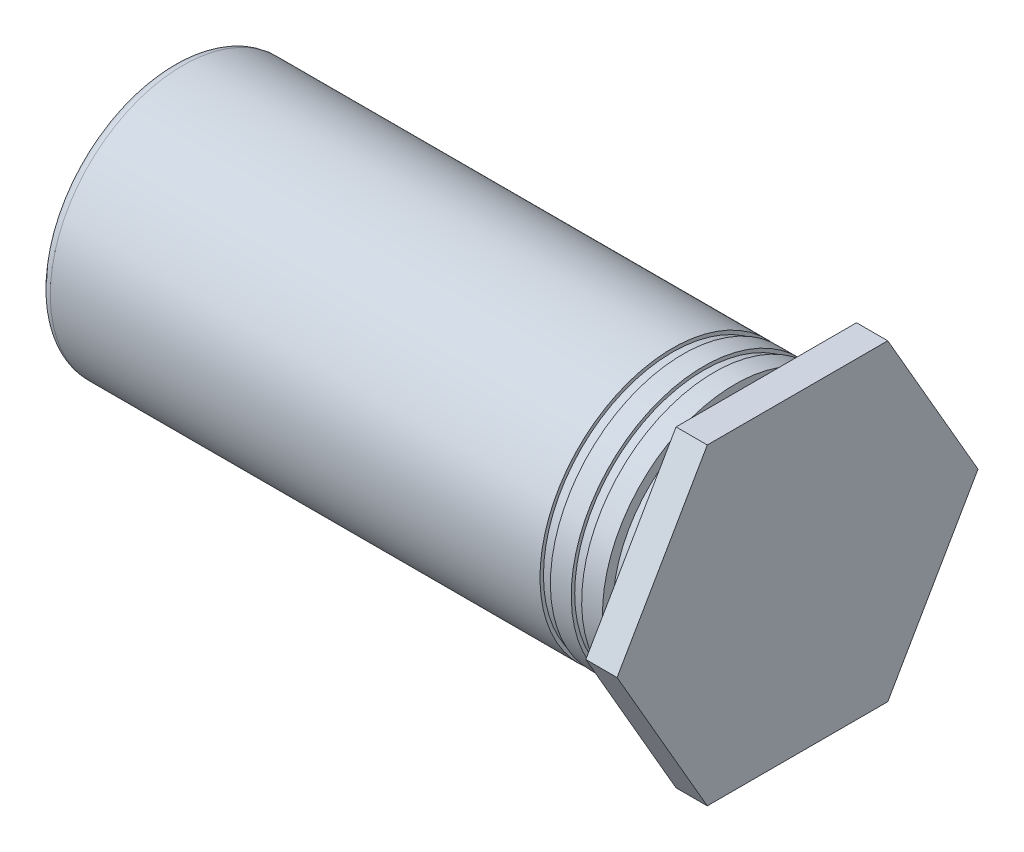
ISO-10303-21;
HEADER;
FILE_DESCRIPTION(('STEP AP214'),'2;1');
FILE_NAME('part.step','',(''),(''),'','','');
FILE_SCHEMA(('AUTOMOTIVE_DESIGN { 1 0 10303 214 1 1 1 1 }'));
ENDSEC;
DATA;
#1=APPLICATION_CONTEXT('core data for automotive mechanical design processes');
#2=APPLICATION_PROTOCOL_DEFINITION('international standard','automotive_design',2000,#1);
#3=PRODUCT_CONTEXT('',#1,'mechanical');
#4=PRODUCT('Part','Part','',(#3));
#5=PRODUCT_RELATED_PRODUCT_CATEGORY('part','',(#4));
#6=PRODUCT_DEFINITION_FORMATION('','',#4);
#7=PRODUCT_DEFINITION_CONTEXT('part definition',#1,'design');
#8=PRODUCT_DEFINITION('design','',#6,#7);
#9=PRODUCT_DEFINITION_SHAPE('','',#8);
#10=(LENGTH_UNIT() NAMED_UNIT(*) SI_UNIT(.MILLI.,.METRE.));
#11=(NAMED_UNIT(*) PLANE_ANGLE_UNIT() SI_UNIT($,.RADIAN.));
#12=(NAMED_UNIT(*) SI_UNIT($,.STERADIAN.) SOLID_ANGLE_UNIT());
#13=UNCERTAINTY_MEASURE_WITH_UNIT(LENGTH_MEASURE(1.E-05),#10,'distance_accuracy_value','');
#14=(GEOMETRIC_REPRESENTATION_CONTEXT(3) GLOBAL_UNCERTAINTY_ASSIGNED_CONTEXT((#13)) GLOBAL_UNIT_ASSIGNED_CONTEXT((#10,
#11,#12)) REPRESENTATION_CONTEXT('',''));
#15=CARTESIAN_POINT('',(0.,0.,0.));
#16=DIRECTION('',(0.,0.,1.));
#17=DIRECTION('',(1.,0.,0.));
#18=AXIS2_PLACEMENT_3D('',#15,#16,#17);
#19=CARTESIAN_POINT('',(0.635000000000001,-1.905,0.));
#20=DIRECTION('',(1.,0.,0.));
#21=DIRECTION('',(0.,1.,0.));
#22=AXIS2_PLACEMENT_3D('',#19,#20,#21);
#23=PLANE('',#22);
#24=DIRECTION('',(0.,0.,-1.));
#25=VECTOR('',#24,1.);
#26=CARTESIAN_POINT('',(0.635,-3.175,0.));
#27=LINE('',#26,#25);
#28=CARTESIAN_POINT('',(0.635,-3.175,-1.83308710467706));
#29=VERTEX_POINT('',#28);
#30=CARTESIAN_POINT('',(0.635,-3.175,1.83308710467706));
#31=VERTEX_POINT('',#30);
#32=EDGE_CURVE('E199',#29,#31,#27,.F.);
#33=ORIENTED_EDGE('',*,*,#32,.F.);
#34=DIRECTION('',(0.,0.866025403784439,-0.5));
#35=VECTOR('',#34,1.);
#36=CARTESIAN_POINT('',(0.635,-1.5875,-2.74963065701559));
#37=LINE('',#36,#35);
#38=CARTESIAN_POINT('',(0.635,0.,-3.66617420935412));
#39=VERTEX_POINT('',#38);
#40=EDGE_CURVE('E73',#39,#29,#37,.F.);
#41=ORIENTED_EDGE('',*,*,#40,.F.);
#42=DIRECTION('',(0.,0.866025403784438,0.500000000000001));
#43=VECTOR('',#42,1.);
#44=CARTESIAN_POINT('',(0.635,1.5875,-2.74963065701559));
#45=LINE('',#44,#43);
#46=CARTESIAN_POINT('',(0.635,3.175,-1.83308710467706));
#47=VERTEX_POINT('',#46);
#48=EDGE_CURVE('E69',#47,#39,#45,.F.);
#49=ORIENTED_EDGE('',*,*,#48,.F.);
#50=DIRECTION('',(0.,0.,1.));
#51=VECTOR('',#50,1.);
#52=CARTESIAN_POINT('',(0.635,3.175,0.));
#53=LINE('',#52,#51);
#54=CARTESIAN_POINT('',(0.635,3.175,1.83308710467706));
#55=VERTEX_POINT('',#54);
#56=EDGE_CURVE('E90',#55,#47,#53,.F.);
#57=ORIENTED_EDGE('',*,*,#56,.F.);
#58=DIRECTION('',(0.,-0.866025403784439,0.5));
#59=VECTOR('',#58,1.);
#60=CARTESIAN_POINT('',(0.635,1.5875,2.74963065701559));
#61=LINE('',#60,#59);
#62=CARTESIAN_POINT('',(0.635,0.,3.66617420935412));
#63=VERTEX_POINT('',#62);
#64=EDGE_CURVE('E210',#63,#55,#61,.F.);
#65=ORIENTED_EDGE('',*,*,#64,.F.);
#66=DIRECTION('',(0.,-0.866025403784438,-0.5));
#67=VECTOR('',#66,1.);
#68=CARTESIAN_POINT('',(0.635,-1.5875,2.74963065701559));
#69=LINE('',#68,#67);
#70=EDGE_CURVE('E203',#31,#63,#69,.F.);
#71=ORIENTED_EDGE('',*,*,#70,.F.);
#72=EDGE_LOOP('',(#33,#41,#49,#57,#65,#71));
#73=FACE_BOUND('',#72,.T.);
#74=ADVANCED_FACE('F17',(#73),#23,.T.);
#75=CARTESIAN_POINT('',(0.3175,1.5875,-2.74963065701559));
#76=DIRECTION('',(0.,0.500000000000001,-0.866025403784438));
#77=DIRECTION('',(0.,0.866025403784438,0.500000000000001));
#78=AXIS2_PLACEMENT_3D('',#75,#76,#77);
#79=PLANE('',#78);
#80=DIRECTION('',(1.,0.,0.));
#81=VECTOR('',#80,1.);
#82=CARTESIAN_POINT('',(0.3175,0.,-3.66617420935412));
#83=LINE('',#82,#81);
#84=CARTESIAN_POINT('',(0.,0.,-3.66617420935412));
#85=VERTEX_POINT('',#84);
#86=EDGE_CURVE('E60',#85,#39,#83,.T.);
#87=ORIENTED_EDGE('',*,*,#86,.F.);
#88=DIRECTION('',(0.,-0.866025403784438,-0.500000000000001));
#89=VECTOR('',#88,1.);
#90=CARTESIAN_POINT('',(0.,3.175,-1.83308710467706));
#91=LINE('',#90,#89);
#92=CARTESIAN_POINT('',(0.,3.175,-1.83308710467706));
#93=VERTEX_POINT('',#92);
#94=EDGE_CURVE('E65',#93,#85,#91,.T.);
#95=ORIENTED_EDGE('',*,*,#94,.F.);
#96=DIRECTION('',(1.,0.,0.));
#97=VECTOR('',#96,1.);
#98=CARTESIAN_POINT('',(0.3175,3.175,-1.83308710467706));
#99=LINE('',#98,#97);
#100=EDGE_CURVE('E186',#47,#93,#99,.F.);
#101=ORIENTED_EDGE('',*,*,#100,.F.);
#102=ORIENTED_EDGE('',*,*,#48,.T.);
#103=EDGE_LOOP('',(#87,#95,#101,#102));
#104=FACE_BOUND('',#103,.T.);
#105=ADVANCED_FACE('F62',(#104),#79,.T.);
#106=CARTESIAN_POINT('',(0.3175,-1.5875,-2.74963065701559));
#107=DIRECTION('',(0.,-0.5,-0.866025403784439));
#108=DIRECTION('',(0.,0.866025403784439,-0.5));
#109=AXIS2_PLACEMENT_3D('',#106,#107,#108);
#110=PLANE('',#109);
#111=DIRECTION('',(1.,0.,0.));
#112=VECTOR('',#111,1.);
#113=CARTESIAN_POINT('',(0.3175,-3.175,-1.83308710467706));
#114=LINE('',#113,#112);
#115=CARTESIAN_POINT('',(0.,-3.175,-1.83308710467706));
#116=VERTEX_POINT('',#115);
#117=EDGE_CURVE('E79',#116,#29,#114,.T.);
#118=ORIENTED_EDGE('',*,*,#117,.F.);
#119=DIRECTION('',(0.,-0.866025403784439,0.5));
#120=VECTOR('',#119,1.);
#121=CARTESIAN_POINT('',(0.,0.,-3.66617420935412));
#122=LINE('',#121,#120);
#123=EDGE_CURVE('E76',#85,#116,#122,.T.);
#124=ORIENTED_EDGE('',*,*,#123,.F.);
#125=ORIENTED_EDGE('',*,*,#86,.T.);
#126=ORIENTED_EDGE('',*,*,#40,.T.);
#127=EDGE_LOOP('',(#118,#124,#125,#126));
#128=FACE_BOUND('',#127,.T.);
#129=ADVANCED_FACE('F77',(#128),#110,.T.);
#130=CARTESIAN_POINT('',(0.3175,-3.175,0.));
#131=DIRECTION('',(0.,-1.,0.));
#132=DIRECTION('',(0.,0.,-1.));
#133=AXIS2_PLACEMENT_3D('',#130,#131,#132);
#134=PLANE('',#133);
#135=DIRECTION('',(1.,0.,0.));
#136=VECTOR('',#135,1.);
#137=CARTESIAN_POINT('',(0.3175,-3.175,1.83308710467706));
#138=LINE('',#137,#136);
#139=CARTESIAN_POINT('',(0.,-3.175,1.83308710467706));
#140=VERTEX_POINT('',#139);
#141=EDGE_CURVE('E196',#140,#31,#138,.T.);
#142=ORIENTED_EDGE('',*,*,#141,.F.);
#143=DIRECTION('',(0.,0.,1.));
#144=VECTOR('',#143,1.);
#145=CARTESIAN_POINT('',(0.,-3.175,0.));
#146=LINE('',#145,#144);
#147=EDGE_CURVE('E83',#116,#140,#146,.T.);
#148=ORIENTED_EDGE('',*,*,#147,.F.);
#149=ORIENTED_EDGE('',*,*,#117,.T.);
#150=ORIENTED_EDGE('',*,*,#32,.T.);
#151=EDGE_LOOP('',(#142,#148,#149,#150));
#152=FACE_BOUND('',#151,.T.);
#153=ADVANCED_FACE('F192',(#152),#134,.T.);
#154=CARTESIAN_POINT('',(0.3175,-1.5875,2.74963065701559));
#155=DIRECTION('',(0.,-0.5,0.866025403784438));
#156=DIRECTION('',(0.,-0.866025403784438,-0.5));
#157=AXIS2_PLACEMENT_3D('',#154,#155,#156);
#158=PLANE('',#157);
#159=DIRECTION('',(1.,0.,0.));
#160=VECTOR('',#159,1.);
#161=CARTESIAN_POINT('',(0.3175,0.,3.66617420935412));
#162=LINE('',#161,#160);
#163=CARTESIAN_POINT('',(0.,0.,3.66617420935412));
#164=VERTEX_POINT('',#163);
#165=EDGE_CURVE('E207',#164,#63,#162,.T.);
#166=ORIENTED_EDGE('',*,*,#165,.F.);
#167=DIRECTION('',(0.,0.866025403784438,0.5));
#168=VECTOR('',#167,1.);
#169=CARTESIAN_POINT('',(0.,-3.175,1.83308710467706));
#170=LINE('',#169,#168);
#171=EDGE_CURVE('E183',#140,#164,#170,.T.);
#172=ORIENTED_EDGE('',*,*,#171,.F.);
#173=ORIENTED_EDGE('',*,*,#141,.T.);
#174=ORIENTED_EDGE('',*,*,#70,.T.);
#175=EDGE_LOOP('',(#166,#172,#173,#174));
#176=FACE_BOUND('',#175,.T.);
#177=ADVANCED_FACE('F205',(#176),#158,.T.);
#178=CARTESIAN_POINT('',(0.3175,1.5875,2.74963065701559));
#179=DIRECTION('',(0.,0.5,0.866025403784439));
#180=DIRECTION('',(0.,-0.866025403784439,0.5));
#181=AXIS2_PLACEMENT_3D('',#178,#179,#180);
#182=PLANE('',#181);
#183=DIRECTION('',(1.,0.,0.));
#184=VECTOR('',#183,1.);
#185=CARTESIAN_POINT('',(0.3175,3.175,1.83308710467706));
#186=LINE('',#185,#184);
#187=CARTESIAN_POINT('',(0.,3.175,1.83308710467706));
#188=VERTEX_POINT('',#187);
#189=EDGE_CURVE('E38',#188,#55,#186,.T.);
#190=ORIENTED_EDGE('',*,*,#189,.F.);
#191=DIRECTION('',(0.,0.866025403784439,-0.5));
#192=VECTOR('',#191,1.);
#193=CARTESIAN_POINT('',(0.,0.,3.66617420935412));
#194=LINE('',#193,#192);
#195=EDGE_CURVE('E181',#164,#188,#194,.T.);
#196=ORIENTED_EDGE('',*,*,#195,.F.);
#197=ORIENTED_EDGE('',*,*,#165,.T.);
#198=ORIENTED_EDGE('',*,*,#64,.T.);
#199=EDGE_LOOP('',(#190,#196,#197,#198));
#200=FACE_BOUND('',#199,.T.);
#201=ADVANCED_FACE('F212',(#200),#182,.T.);
#202=CARTESIAN_POINT('',(0.3175,3.175,0.));
#203=DIRECTION('',(0.,1.,0.));
#204=DIRECTION('',(0.,0.,1.));
#205=AXIS2_PLACEMENT_3D('',#202,#203,#204);
#206=PLANE('',#205);
#207=ORIENTED_EDGE('',*,*,#189,.T.);
#208=ORIENTED_EDGE('',*,*,#56,.T.);
#209=ORIENTED_EDGE('',*,*,#100,.T.);
#210=DIRECTION('',(0.,0.,1.));
#211=VECTOR('',#210,1.);
#212=CARTESIAN_POINT('',(0.,3.175,0.));
#213=LINE('',#212,#211);
#214=EDGE_CURVE('E89',#188,#93,#213,.F.);
#215=ORIENTED_EDGE('',*,*,#214,.F.);
#216=EDGE_LOOP('',(#207,#208,#209,#215));
#217=FACE_BOUND('',#216,.T.);
#218=ADVANCED_FACE('F214',(#217),#206,.T.);
#219=CARTESIAN_POINT('',(0.,-3.2512,0.));
#220=DIRECTION('',(-1.,0.,0.));
#221=DIRECTION('',(0.,-1.,0.));
#222=AXIS2_PLACEMENT_3D('',#219,#220,#221);
#223=PLANE('',#222);
#224=ORIENTED_EDGE('',*,*,#195,.T.);
#225=ORIENTED_EDGE('',*,*,#214,.T.);
#226=ORIENTED_EDGE('',*,*,#94,.T.);
#227=ORIENTED_EDGE('',*,*,#123,.T.);
#228=ORIENTED_EDGE('',*,*,#147,.T.);
#229=ORIENTED_EDGE('',*,*,#171,.T.);
#230=EDGE_LOOP('',(#224,#225,#226,#227,#228,#229));
#231=FACE_BOUND('',#230,.T.);
#232=CARTESIAN_POINT('',(0.,0.,0.));
#233=DIRECTION('',(-1.,0.,0.));
#234=DIRECTION('',(0.,0.,1.));
#235=AXIS2_PLACEMENT_3D('',#232,#233,#234);
#236=CIRCLE('',#235,2.48073333333333);
#237=CARTESIAN_POINT('',(0.,0.,2.48073333333333));
#238=VERTEX_POINT('',#237);
#239=EDGE_CURVE('E21',#238,#238,#236,.F.);
#240=ORIENTED_EDGE('',*,*,#239,.T.);
#241=EDGE_LOOP('',(#240));
#242=FACE_BOUND('',#241,.T.);
#243=ADVANCED_FACE('F87',(#231,#242),#223,.T.);
#244=CARTESIAN_POINT('',(0.,0.,0.));
#245=DIRECTION('',(-1.,0.,0.));
#246=DIRECTION('',(0.,0.,1.));
#247=AXIS2_PLACEMENT_3D('',#244,#245,#246);
#248=CYLINDRICAL_SURFACE('',#247,2.48073333333333);
#249=ORIENTED_EDGE('',*,*,#239,.F.);
#250=EDGE_LOOP('',(#249));
#251=FACE_BOUND('',#250,.T.);
#252=CARTESIAN_POINT('',(-0.635,0.,0.));
#253=DIRECTION('',(-1.,0.,0.));
#254=DIRECTION('',(0.,0.,1.));
#255=AXIS2_PLACEMENT_3D('',#252,#253,#254);
#256=CIRCLE('',#255,2.48073333333333);
#257=CARTESIAN_POINT('',(-0.635,0.,2.48073333333333));
#258=VERTEX_POINT('',#257);
#259=EDGE_CURVE('E175',#258,#258,#256,.F.);
#260=ORIENTED_EDGE('',*,*,#259,.T.);
#261=EDGE_LOOP('',(#260));
#262=FACE_BOUND('',#261,.T.);
#263=ADVANCED_FACE('F331',(#251,#262),#248,.T.);
#264=CARTESIAN_POINT('',(-0.635,0.,-2.58656666666667));
#265=DIRECTION('',(-1.,0.,0.));
#266=DIRECTION('',(0.,0.,1.));
#267=AXIS2_PLACEMENT_3D('',#264,#265,#266);
#268=PLANE('',#267);
#269=CARTESIAN_POINT('',(-0.635,0.,0.));
#270=DIRECTION('',(-1.,0.,0.));
#271=DIRECTION('',(0.,-1.,0.));
#272=AXIS2_PLACEMENT_3D('',#269,#270,#271);
#273=CIRCLE('',#272,2.6924);
#274=CARTESIAN_POINT('',(-0.635,-2.6924,0.));
#275=VERTEX_POINT('',#274);
#276=EDGE_CURVE('E173',#275,#275,#273,.T.);
#277=ORIENTED_EDGE('',*,*,#276,.F.);
#278=EDGE_LOOP('',(#277));
#279=FACE_BOUND('',#278,.T.);
#280=ORIENTED_EDGE('',*,*,#259,.F.);
#281=EDGE_LOOP('',(#280));
#282=FACE_BOUND('',#281,.T.);
#283=ADVANCED_FACE('F323',(#279,#282),#268,.F.);
#284=CARTESIAN_POINT('',(-5.92666666666667,0.,0.));
#285=DIRECTION('',(-1.,0.,0.));
#286=DIRECTION('',(0.,-1.,0.));
#287=AXIS2_PLACEMENT_3D('',#284,#285,#286);
#288=CYLINDRICAL_SURFACE('',#287,2.6924);
#289=CARTESIAN_POINT('',(-1.05833333333333,0.,0.));
#290=DIRECTION('',(-1.,0.,0.));
#291=DIRECTION('',(0.,-1.,0.));
#292=AXIS2_PLACEMENT_3D('',#289,#290,#291);
#293=CIRCLE('',#292,2.6924);
#294=CARTESIAN_POINT('',(-1.05833333333333,-2.6924,0.));
#295=VERTEX_POINT('',#294);
#296=EDGE_CURVE('E170',#295,#295,#293,.F.);
#297=ORIENTED_EDGE('',*,*,#296,.T.);
#298=EDGE_LOOP('',(#297));
#299=FACE_BOUND('',#298,.T.);
#300=ORIENTED_EDGE('',*,*,#276,.T.);
#301=EDGE_LOOP('',(#300));
#302=FACE_BOUND('',#301,.T.);
#303=ADVANCED_FACE('F316',(#299,#302),#288,.T.);
#304=CARTESIAN_POINT('',(-1.05833333333333,0.,-2.65712222222222));
#305=DIRECTION('',(1.,0.,0.));
#306=DIRECTION('',(0.,1.,0.));
#307=AXIS2_PLACEMENT_3D('',#304,#305,#306);
#308=PLANE('',#307);
#309=CARTESIAN_POINT('',(-1.05833333333333,0.,0.));
#310=DIRECTION('',(-1.,0.,0.));
#311=DIRECTION('',(0.,0.,1.));
#312=AXIS2_PLACEMENT_3D('',#309,#310,#311);
#313=CIRCLE('',#312,2.62184444444444);
#314=CARTESIAN_POINT('',(-1.05833333333333,0.,2.62184444444444));
#315=VERTEX_POINT('',#314);
#316=EDGE_CURVE('E144',#315,#315,#313,.F.);
#317=ORIENTED_EDGE('',*,*,#316,.T.);
#318=EDGE_LOOP('',(#317));
#319=FACE_BOUND('',#318,.T.);
#320=ORIENTED_EDGE('',*,*,#296,.F.);
#321=EDGE_LOOP('',(#320));
#322=FACE_BOUND('',#321,.T.);
#323=ADVANCED_FACE('F280',(#319,#322),#308,.F.);
#324=CARTESIAN_POINT('',(-1.90499999996518,0.,0.));
#325=DIRECTION('',(-1.,0.,0.));
#326=DIRECTION('',(0.,-1.,0.));
#327=AXIS2_PLACEMENT_3D('',#324,#325,#326);
#328=CONICAL_SURFACE('',#327,1.48589999992055,1.0471975510434);
#329=CARTESIAN_POINT('',(-1.04711523491119,0.,5.68440304762754E-11));
#330=VERTEX_POINT('',#329);
#331=VERTEX_LOOP('',#330);
#332=FACE_BOUND('',#331,.T.);
#333=CARTESIAN_POINT('',(-1.905,0.,0.));
#334=DIRECTION('',(-1.,0.,0.));
#335=DIRECTION('',(0.,-1.,0.));
#336=AXIS2_PLACEMENT_3D('',#333,#334,#335);
#337=CIRCLE('',#336,1.4859);
#338=CARTESIAN_POINT('',(-1.905,-1.4859,0.));
#339=VERTEX_POINT('',#338);
#340=EDGE_CURVE('E140',#339,#339,#337,.T.);
#341=ORIENTED_EDGE('',*,*,#340,.T.);
#342=EDGE_LOOP('',(#341));
#343=FACE_BOUND('',#342,.T.);
#344=ADVANCED_FACE('F270',(#332,#343),#328,.F.);
#345=CARTESIAN_POINT('',(-1.05833333333333,0.,0.));
#346=DIRECTION('',(-1.,0.,0.));
#347=DIRECTION('',(0.,0.,1.));
#348=AXIS2_PLACEMENT_3D('',#345,#346,#347);
#349=CYLINDRICAL_SURFACE('',#348,2.62184444444444);
#350=ORIENTED_EDGE('',*,*,#316,.F.);
#351=EDGE_LOOP('',(#350));
#352=FACE_BOUND('',#351,.T.);
#353=CARTESIAN_POINT('',(-1.27,0.,0.));
#354=DIRECTION('',(-1.,0.,0.));
#355=DIRECTION('',(0.,0.,1.));
#356=AXIS2_PLACEMENT_3D('',#353,#354,#355);
#357=CIRCLE('',#356,2.62184444444444);
#358=CARTESIAN_POINT('',(-1.27,0.,2.62184444444444));
#359=VERTEX_POINT('',#358);
#360=EDGE_CURVE('E143',#359,#359,#357,.F.);
#361=ORIENTED_EDGE('',*,*,#360,.T.);
#362=EDGE_LOOP('',(#361));
#363=FACE_BOUND('',#362,.T.);
#364=ADVANCED_FACE('F268',(#352,#363),#349,.T.);
#365=CARTESIAN_POINT('',(-3.81,0.,0.));
#366=DIRECTION('',(-1.,0.,0.));
#367=DIRECTION('',(0.,-1.,0.));
#368=AXIS2_PLACEMENT_3D('',#365,#366,#367);
#369=CYLINDRICAL_SURFACE('',#368,1.4859);
#370=CARTESIAN_POINT('',(-5.715,0.,0.));
#371=DIRECTION('',(-1.,0.,0.));
#372=DIRECTION('',(0.,-1.,0.));
#373=AXIS2_PLACEMENT_3D('',#370,#371,#372);
#374=CIRCLE('',#373,1.4859);
#375=CARTESIAN_POINT('',(-5.715,-1.4859,0.));
#376=VERTEX_POINT('',#375);
#377=EDGE_CURVE('E163',#376,#376,#374,.F.);
#378=ORIENTED_EDGE('',*,*,#377,.F.);
#379=EDGE_LOOP('',(#378));
#380=FACE_BOUND('',#379,.T.);
#381=ORIENTED_EDGE('',*,*,#340,.F.);
#382=EDGE_LOOP('',(#381));
#383=FACE_BOUND('',#382,.T.);
#384=ADVANCED_FACE('F264',(#380,#383),#369,.F.);
#385=CARTESIAN_POINT('',(-1.27,0.,-2.65712222222222));
#386=DIRECTION('',(-1.,0.,0.));
#387=DIRECTION('',(0.,0.,1.));
#388=AXIS2_PLACEMENT_3D('',#385,#386,#387);
#389=PLANE('',#388);
#390=CARTESIAN_POINT('',(-1.27,0.,0.));
#391=DIRECTION('',(-1.,0.,0.));
#392=DIRECTION('',(0.,-1.,0.));
#393=AXIS2_PLACEMENT_3D('',#390,#391,#392);
#394=CIRCLE('',#393,2.6924);
#395=CARTESIAN_POINT('',(-1.27,-2.6924,0.));
#396=VERTEX_POINT('',#395);
#397=EDGE_CURVE('E160',#396,#396,#394,.T.);
#398=ORIENTED_EDGE('',*,*,#397,.F.);
#399=EDGE_LOOP('',(#398));
#400=FACE_BOUND('',#399,.T.);
#401=ORIENTED_EDGE('',*,*,#360,.F.);
#402=EDGE_LOOP('',(#401));
#403=FACE_BOUND('',#402,.T.);
#404=ADVANCED_FACE('F261',(#400,#403),#389,.F.);
#405=CARTESIAN_POINT('',(-5.715,0.,-1.55575));
#406=DIRECTION('',(1.,0.,0.));
#407=DIRECTION('',(0.,0.,-1.));
#408=AXIS2_PLACEMENT_3D('',#405,#406,#407);
#409=PLANE('',#408);
#410=CARTESIAN_POINT('',(-5.715,0.,0.));
#411=DIRECTION('',(-1.,0.,0.));
#412=DIRECTION('',(0.,-1.,0.));
#413=AXIS2_PLACEMENT_3D('',#410,#411,#412);
#414=CIRCLE('',#413,1.3589);
#415=CARTESIAN_POINT('',(-5.715,-1.3589,0.));
#416=VERTEX_POINT('',#415);
#417=EDGE_CURVE('E157',#416,#416,#414,.F.);
#418=ORIENTED_EDGE('',*,*,#417,.F.);
#419=EDGE_LOOP('',(#418));
#420=FACE_BOUND('',#419,.T.);
#421=ORIENTED_EDGE('',*,*,#377,.T.);
#422=EDGE_LOOP('',(#421));
#423=FACE_BOUND('',#422,.T.);
#424=ADVANCED_FACE('F257',(#420,#423),#409,.T.);
#425=CARTESIAN_POINT('',(-5.92666666666667,0.,0.));
#426=DIRECTION('',(-1.,0.,0.));
#427=DIRECTION('',(0.,-1.,0.));
#428=AXIS2_PLACEMENT_3D('',#425,#426,#427);
#429=CYLINDRICAL_SURFACE('',#428,2.6924);
#430=CARTESIAN_POINT('',(-1.69333333333333,0.,0.));
#431=DIRECTION('',(-1.,0.,0.));
#432=DIRECTION('',(0.,-1.,0.));
#433=AXIS2_PLACEMENT_3D('',#430,#431,#432);
#434=CIRCLE('',#433,2.6924);
#435=CARTESIAN_POINT('',(-1.69333333333333,-2.6924,0.));
#436=VERTEX_POINT('',#435);
#437=EDGE_CURVE('E139',#436,#436,#434,.F.);
#438=ORIENTED_EDGE('',*,*,#437,.T.);
#439=EDGE_LOOP('',(#438));
#440=FACE_BOUND('',#439,.T.);
#441=ORIENTED_EDGE('',*,*,#397,.T.);
#442=EDGE_LOOP('',(#441));
#443=FACE_BOUND('',#442,.T.);
#444=ADVANCED_FACE('F254',(#440,#443),#429,.T.);
#445=CARTESIAN_POINT('',(-5.715,0.,0.));
#446=DIRECTION('',(-1.,0.,0.));
#447=DIRECTION('',(0.,-1.,0.));
#448=AXIS2_PLACEMENT_3D('',#445,#446,#447);
#449=CYLINDRICAL_SURFACE('',#448,1.3589);
#450=ORIENTED_EDGE('',*,*,#417,.T.);
#451=EDGE_LOOP('',(#450));
#452=FACE_BOUND('',#451,.T.);
#453=CARTESIAN_POINT('',(-11.6712999999891,0.,0.));
#454=DIRECTION('',(-1.,0.,0.));
#455=DIRECTION('',(0.,0.,-1.));
#456=AXIS2_PLACEMENT_3D('',#453,#454,#455);
#457=CIRCLE('',#456,1.35890000001382);
#458=CARTESIAN_POINT('',(-11.6712999999891,0.,-1.35890000001382));
#459=VERTEX_POINT('',#458);
#460=EDGE_CURVE('E130',#459,#459,#457,.F.);
#461=ORIENTED_EDGE('',*,*,#460,.F.);
#462=EDGE_LOOP('',(#461));
#463=FACE_BOUND('',#462,.T.);
#464=ADVANCED_FACE('F250',(#452,#463),#449,.F.);
#465=CARTESIAN_POINT('',(-1.69333333333333,0.,-2.65712222222222));
#466=DIRECTION('',(1.,0.,0.));
#467=DIRECTION('',(0.,1.,0.));
#468=AXIS2_PLACEMENT_3D('',#465,#466,#467);
#469=PLANE('',#468);
#470=CARTESIAN_POINT('',(-1.69333333333333,0.,0.));
#471=DIRECTION('',(-1.,0.,0.));
#472=DIRECTION('',(0.,0.,1.));
#473=AXIS2_PLACEMENT_3D('',#470,#471,#472);
#474=CIRCLE('',#473,2.62184444444444);
#475=CARTESIAN_POINT('',(-1.69333333333333,0.,2.62184444444444));
#476=VERTEX_POINT('',#475);
#477=EDGE_CURVE('E138',#476,#476,#474,.F.);
#478=ORIENTED_EDGE('',*,*,#477,.T.);
#479=EDGE_LOOP('',(#478));
#480=FACE_BOUND('',#479,.T.);
#481=ORIENTED_EDGE('',*,*,#437,.F.);
#482=EDGE_LOOP('',(#481));
#483=FACE_BOUND('',#482,.T.);
#484=ADVANCED_FACE('F244',(#480,#483),#469,.F.);
#485=CARTESIAN_POINT('',(-11.6712999999891,0.,0.));
#486=DIRECTION('',(-1.,0.,0.));
#487=DIRECTION('',(0.,0.,1.));
#488=AXIS2_PLACEMENT_3D('',#485,#486,#487);
#489=CONICAL_SURFACE('',#488,1.35890000001382,0.785398163397448);
#490=ORIENTED_EDGE('',*,*,#460,.T.);
#491=EDGE_LOOP('',(#490));
#492=FACE_BOUND('',#491,.T.);
#493=CARTESIAN_POINT('',(-12.06499999995,0.,0.));
#494=DIRECTION('',(-1.,0.,0.));
#495=DIRECTION('',(0.,0.,1.));
#496=AXIS2_PLACEMENT_3D('',#493,#494,#495);
#497=CIRCLE('',#496,1.75259999997479);
#498=CARTESIAN_POINT('',(-12.06499999995,0.,1.75259999997479));
#499=VERTEX_POINT('',#498);
#500=EDGE_CURVE('E150',#499,#499,#497,.F.);
#501=ORIENTED_EDGE('',*,*,#500,.F.);
#502=EDGE_LOOP('',(#501));
#503=FACE_BOUND('',#502,.T.);
#504=ADVANCED_FACE('F238',(#492,#503),#489,.F.);
#505=CARTESIAN_POINT('',(-1.69333333333333,0.,0.));
#506=DIRECTION('',(-1.,0.,0.));
#507=DIRECTION('',(0.,0.,1.));
#508=AXIS2_PLACEMENT_3D('',#505,#506,#507);
#509=CYLINDRICAL_SURFACE('',#508,2.62184444444444);
#510=ORIENTED_EDGE('',*,*,#477,.F.);
#511=EDGE_LOOP('',(#510));
#512=FACE_BOUND('',#511,.T.);
#513=CARTESIAN_POINT('',(-1.905,0.,0.));
#514=DIRECTION('',(-1.,0.,0.));
#515=DIRECTION('',(0.,0.,1.));
#516=AXIS2_PLACEMENT_3D('',#513,#514,#515);
#517=CIRCLE('',#516,2.62184444444444);
#518=CARTESIAN_POINT('',(-1.905,0.,2.62184444444444));
#519=VERTEX_POINT('',#518);
#520=EDGE_CURVE('E147',#519,#519,#517,.F.);
#521=ORIENTED_EDGE('',*,*,#520,.T.);
#522=EDGE_LOOP('',(#521));
#523=FACE_BOUND('',#522,.T.);
#524=ADVANCED_FACE('F117',(#512,#523),#509,.T.);
#525=CARTESIAN_POINT('',(-12.065,-1.24036666666667,0.));
#526=DIRECTION('',(-1.,0.,0.));
#527=DIRECTION('',(0.,-1.,0.));
#528=AXIS2_PLACEMENT_3D('',#525,#526,#527);
#529=PLANE('',#528);
#530=CARTESIAN_POINT('',(-12.065,0.,0.));
#531=DIRECTION('',(1.,0.,0.));
#532=DIRECTION('',(0.,-1.,0.));
#533=AXIS2_PLACEMENT_3D('',#530,#531,#532);
#534=CIRCLE('',#533,2.48073333333333);
#535=CARTESIAN_POINT('',(-12.065,-2.48073333333333,0.));
#536=VERTEX_POINT('',#535);
#537=EDGE_CURVE('E100',#536,#536,#534,.T.);
#538=ORIENTED_EDGE('',*,*,#537,.F.);
#539=EDGE_LOOP('',(#538));
#540=FACE_BOUND('',#539,.T.);
#541=ORIENTED_EDGE('',*,*,#500,.T.);
#542=EDGE_LOOP('',(#541));
#543=FACE_BOUND('',#542,.T.);
#544=ADVANCED_FACE('F106',(#540,#543),#529,.T.);
#545=CARTESIAN_POINT('',(-1.905,0.,-2.65712222222222));
#546=DIRECTION('',(-1.,0.,0.));
#547=DIRECTION('',(0.,0.,1.));
#548=AXIS2_PLACEMENT_3D('',#545,#546,#547);
#549=PLANE('',#548);
#550=CARTESIAN_POINT('',(-1.905,0.,0.));
#551=DIRECTION('',(-1.,0.,0.));
#552=DIRECTION('',(0.,-1.,0.));
#553=AXIS2_PLACEMENT_3D('',#550,#551,#552);
#554=CIRCLE('',#553,2.6924);
#555=CARTESIAN_POINT('',(-1.905,-2.6924,0.));
#556=VERTEX_POINT('',#555);
#557=EDGE_CURVE('E26',#556,#556,#554,.T.);
#558=ORIENTED_EDGE('',*,*,#557,.F.);
#559=EDGE_LOOP('',(#558));
#560=FACE_BOUND('',#559,.T.);
#561=ORIENTED_EDGE('',*,*,#520,.F.);
#562=EDGE_LOOP('',(#561));
#563=FACE_BOUND('',#562,.T.);
#564=ADVANCED_FACE('F116',(#560,#563),#549,.F.);
#565=CARTESIAN_POINT('',(-11.8533333333333,0.,0.));
#566=DIRECTION('',(-1.,0.,0.));
#567=DIRECTION('',(0.,-1.,0.));
#568=AXIS2_PLACEMENT_3D('',#565,#566,#567);
#569=TOROIDAL_SURFACE('',#568,2.48073333333333,0.211666666666666);
#570=CARTESIAN_POINT('',(-11.8533333333333,0.,0.));
#571=DIRECTION('',(-1.,0.,0.));
#572=DIRECTION('',(0.,-1.,0.));
#573=AXIS2_PLACEMENT_3D('',#570,#571,#572);
#574=CIRCLE('',#573,2.6924);
#575=CARTESIAN_POINT('',(-11.8533333333333,-2.6924,0.));
#576=VERTEX_POINT('',#575);
#577=EDGE_CURVE('E11',#576,#576,#574,.F.);
#578=ORIENTED_EDGE('',*,*,#577,.F.);
#579=EDGE_LOOP('',(#578));
#580=FACE_BOUND('',#579,.T.);
#581=ORIENTED_EDGE('',*,*,#537,.T.);
#582=EDGE_LOOP('',(#581));
#583=FACE_BOUND('',#582,.T.);
#584=ADVANCED_FACE('F120',(#580,#583),#569,.T.);
#585=CARTESIAN_POINT('',(-5.92666666666667,0.,0.));
#586=DIRECTION('',(-1.,0.,0.));
#587=DIRECTION('',(0.,-1.,0.));
#588=AXIS2_PLACEMENT_3D('',#585,#586,#587);
#589=CYLINDRICAL_SURFACE('',#588,2.6924);
#590=ORIENTED_EDGE('',*,*,#557,.T.);
#591=EDGE_LOOP('',(#590));
#592=FACE_BOUND('',#591,.T.);
#593=ORIENTED_EDGE('',*,*,#577,.T.);
#594=EDGE_LOOP('',(#593));
#595=FACE_BOUND('',#594,.T.);
#596=ADVANCED_FACE('F19',(#592,#595),#589,.T.);
#597=CLOSED_SHELL('',(#74,#105,#129,#153,#177,#201,#218,#243,#263,#283,#303,#323,#344,#364,#384,
#404,#424,#444,#464,#484,#504,#524,#544,#564,#584,#596));
#598=MANIFOLD_SOLID_BREP('B1',#597);
#599=ADVANCED_BREP_SHAPE_REPRESENTATION('',(#18,#598),#14);
#600=SHAPE_DEFINITION_REPRESENTATION(#9,#599);
ENDSEC;
END-ISO-10303-21;
